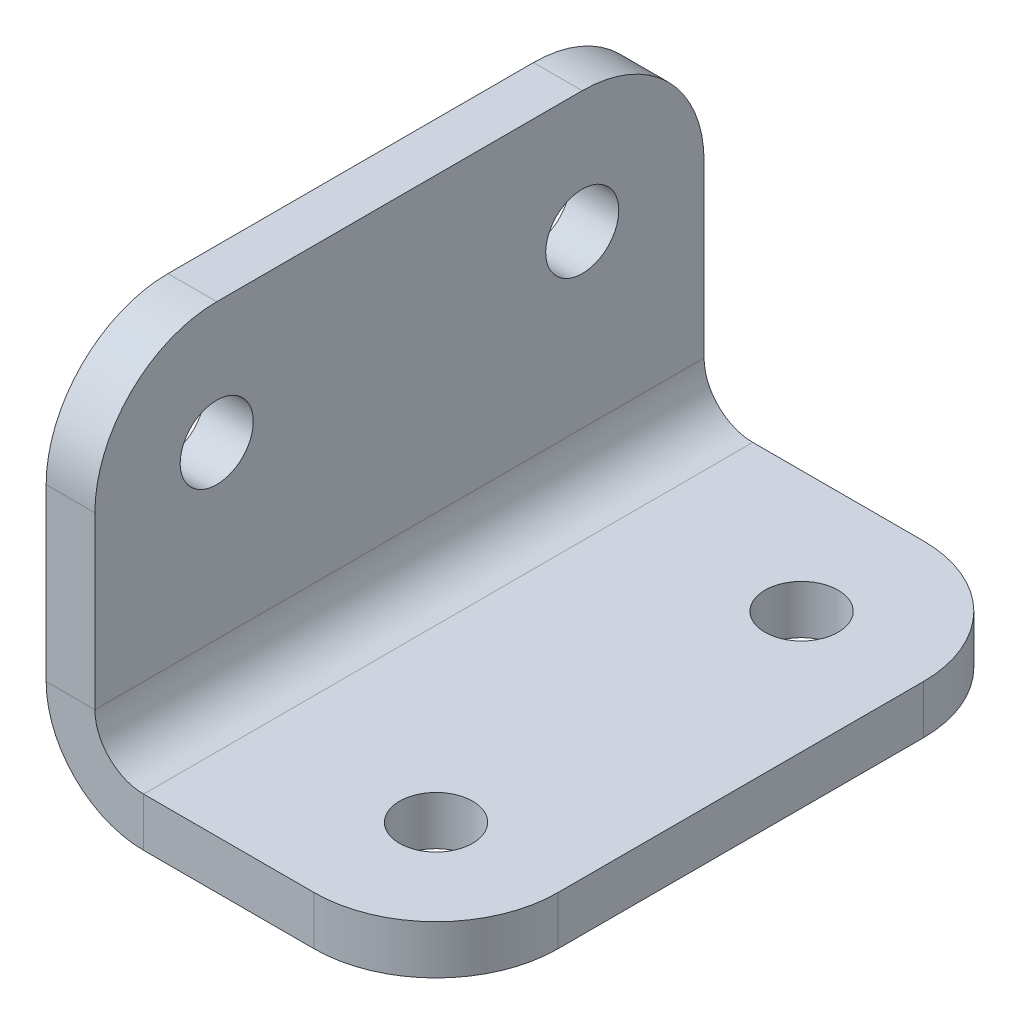
ISO-10303-21;
HEADER;
FILE_DESCRIPTION(('STEP AP214'),'2;1');
FILE_NAME('part.step','',(''),(''),'','','');
FILE_SCHEMA(('AUTOMOTIVE_DESIGN { 1 0 10303 214 1 1 1 1 }'));
ENDSEC;
DATA;
#1=APPLICATION_CONTEXT('core data for automotive mechanical design processes');
#2=APPLICATION_PROTOCOL_DEFINITION('international standard','automotive_design',2000,#1);
#3=PRODUCT_CONTEXT('',#1,'mechanical');
#4=PRODUCT('Part','Part','',(#3));
#5=PRODUCT_RELATED_PRODUCT_CATEGORY('part','',(#4));
#6=PRODUCT_DEFINITION_FORMATION('','',#4);
#7=PRODUCT_DEFINITION_CONTEXT('part definition',#1,'design');
#8=PRODUCT_DEFINITION('design','',#6,#7);
#9=PRODUCT_DEFINITION_SHAPE('','',#8);
#10=(LENGTH_UNIT() NAMED_UNIT(*) SI_UNIT(.MILLI.,.METRE.));
#11=(NAMED_UNIT(*) PLANE_ANGLE_UNIT() SI_UNIT($,.RADIAN.));
#12=(NAMED_UNIT(*) SI_UNIT($,.STERADIAN.) SOLID_ANGLE_UNIT());
#13=UNCERTAINTY_MEASURE_WITH_UNIT(LENGTH_MEASURE(1.E-05),#10,'distance_accuracy_value','');
#14=(GEOMETRIC_REPRESENTATION_CONTEXT(3) GLOBAL_UNCERTAINTY_ASSIGNED_CONTEXT((#13)) GLOBAL_UNIT_ASSIGNED_CONTEXT((#10,
#11,#12)) REPRESENTATION_CONTEXT('',''));
#15=CARTESIAN_POINT('',(0.,0.,0.));
#16=DIRECTION('',(0.,0.,1.));
#17=DIRECTION('',(1.,0.,0.));
#18=AXIS2_PLACEMENT_3D('',#15,#16,#17);
#19=CARTESIAN_POINT('',(4.,2.,25.));
#20=DIRECTION('',(0.,0.,1.));
#21=DIRECTION('',(1.,0.,0.));
#22=AXIS2_PLACEMENT_3D('',#19,#20,#21);
#23=PLANE('',#22);
#24=DIRECTION('',(0.,-1.,0.));
#25=VECTOR('',#24,1.);
#26=CARTESIAN_POINT('',(2.,20.,25.));
#27=LINE('',#26,#25);
#28=CARTESIAN_POINT('',(2.,11.,25.));
#29=VERTEX_POINT('',#28);
#30=CARTESIAN_POINT('',(2.,4.,25.));
#31=VERTEX_POINT('',#30);
#32=EDGE_CURVE('E254',#29,#31,#27,.T.);
#33=ORIENTED_EDGE('',*,*,#32,.F.);
#34=DIRECTION('',(1.,0.,0.));
#35=VECTOR('',#34,1.);
#36=CARTESIAN_POINT('',(0.,11.,25.));
#37=LINE('',#36,#35);
#38=CARTESIAN_POINT('',(0.,11.,25.));
#39=VERTEX_POINT('',#38);
#40=EDGE_CURVE('E174',#39,#29,#37,.T.);
#41=ORIENTED_EDGE('',*,*,#40,.F.);
#42=DIRECTION('',(0.,-1.,0.));
#43=VECTOR('',#42,1.);
#44=CARTESIAN_POINT('',(0.,20.,25.));
#45=LINE('',#44,#43);
#46=CARTESIAN_POINT('',(0.,4.,25.));
#47=VERTEX_POINT('',#46);
#48=EDGE_CURVE('E156',#39,#47,#45,.T.);
#49=ORIENTED_EDGE('',*,*,#48,.T.);
#50=DIRECTION('',(1.,0.,0.));
#51=VECTOR('',#50,1.);
#52=CARTESIAN_POINT('',(0.,4.,25.));
#53=LINE('',#52,#51);
#54=EDGE_CURVE('E11',#47,#31,#53,.T.);
#55=ORIENTED_EDGE('',*,*,#54,.T.);
#56=EDGE_LOOP('',(#33,#41,#49,#55));
#57=FACE_BOUND('',#56,.T.);
#58=ADVANCED_FACE('F40',(#57),#23,.T.);
#59=CARTESIAN_POINT('',(4.,4.,0.));
#60=DIRECTION('',(0.,0.,1.));
#61=DIRECTION('',(1.,0.,0.));
#62=AXIS2_PLACEMENT_3D('',#59,#60,#61);
#63=PLANE('',#62);
#64=DIRECTION('',(1.,0.,0.));
#65=VECTOR('',#64,1.);
#66=CARTESIAN_POINT('',(0.,11.,0.));
#67=LINE('',#66,#65);
#68=CARTESIAN_POINT('',(0.,11.,0.));
#69=VERTEX_POINT('',#68);
#70=CARTESIAN_POINT('',(2.,11.,0.));
#71=VERTEX_POINT('',#70);
#72=EDGE_CURVE('E178',#69,#71,#67,.T.);
#73=ORIENTED_EDGE('',*,*,#72,.T.);
#74=DIRECTION('',(0.,-1.,0.));
#75=VECTOR('',#74,1.);
#76=CARTESIAN_POINT('',(2.,20.,0.));
#77=LINE('',#76,#75);
#78=CARTESIAN_POINT('',(2.,4.,0.));
#79=VERTEX_POINT('',#78);
#80=EDGE_CURVE('E274',#71,#79,#77,.T.);
#81=ORIENTED_EDGE('',*,*,#80,.T.);
#82=DIRECTION('',(-1.,0.,0.));
#83=VECTOR('',#82,1.);
#84=CARTESIAN_POINT('',(2.,4.,0.));
#85=LINE('',#84,#83);
#86=CARTESIAN_POINT('',(0.,4.,0.));
#87=VERTEX_POINT('',#86);
#88=EDGE_CURVE('E298',#79,#87,#85,.T.);
#89=ORIENTED_EDGE('',*,*,#88,.T.);
#90=DIRECTION('',(0.,-1.,0.));
#91=VECTOR('',#90,1.);
#92=CARTESIAN_POINT('',(0.,20.,0.));
#93=LINE('',#92,#91);
#94=EDGE_CURVE('E277',#69,#87,#93,.T.);
#95=ORIENTED_EDGE('',*,*,#94,.F.);
#96=EDGE_LOOP('',(#73,#81,#89,#95));
#97=FACE_BOUND('',#96,.T.);
#98=ADVANCED_FACE('F342',(#97),#63,.F.);
#99=CARTESIAN_POINT('',(2.,4.,0.));
#100=DIRECTION('',(0.,0.,-1.));
#101=DIRECTION('',(-1.,0.,0.));
#102=AXIS2_PLACEMENT_3D('',#99,#100,#101);
#103=PLANE('',#102);
#104=DIRECTION('',(1.,0.,0.));
#105=VECTOR('',#104,1.);
#106=CARTESIAN_POINT('',(0.,2.,0.));
#107=LINE('',#106,#105);
#108=CARTESIAN_POINT('',(4.,2.,0.));
#109=VERTEX_POINT('',#108);
#110=CARTESIAN_POINT('',(11.,2.,0.));
#111=VERTEX_POINT('',#110);
#112=EDGE_CURVE('E267',#109,#111,#107,.T.);
#113=ORIENTED_EDGE('',*,*,#112,.T.);
#114=DIRECTION('',(0.,1.,0.));
#115=VECTOR('',#114,1.);
#116=CARTESIAN_POINT('',(11.,0.,0.));
#117=LINE('',#116,#115);
#118=CARTESIAN_POINT('',(11.,0.,0.));
#119=VERTEX_POINT('',#118);
#120=EDGE_CURVE('E221',#119,#111,#117,.T.);
#121=ORIENTED_EDGE('',*,*,#120,.F.);
#122=DIRECTION('',(1.,0.,0.));
#123=VECTOR('',#122,1.);
#124=CARTESIAN_POINT('',(0.,0.,0.));
#125=LINE('',#124,#123);
#126=CARTESIAN_POINT('',(4.,0.,0.));
#127=VERTEX_POINT('',#126);
#128=EDGE_CURVE('E237',#127,#119,#125,.T.);
#129=ORIENTED_EDGE('',*,*,#128,.F.);
#130=DIRECTION('',(0.,1.,0.));
#131=VECTOR('',#130,1.);
#132=CARTESIAN_POINT('',(4.,0.,0.));
#133=LINE('',#132,#131);
#134=EDGE_CURVE('E302',#127,#109,#133,.T.);
#135=ORIENTED_EDGE('',*,*,#134,.T.);
#136=EDGE_LOOP('',(#113,#121,#129,#135));
#137=FACE_BOUND('',#136,.T.);
#138=ADVANCED_FACE('F346',(#137),#103,.T.);
#139=CARTESIAN_POINT('',(0.,4.,25.));
#140=DIRECTION('',(0.,0.,1.));
#141=DIRECTION('',(1.,0.,0.));
#142=AXIS2_PLACEMENT_3D('',#139,#140,#141);
#143=PLANE('',#142);
#144=ORIENTED_EDGE('',*,*,#54,.F.);
#145=CARTESIAN_POINT('',(4.,4.,25.));
#146=DIRECTION('',(0.,0.,-1.));
#147=DIRECTION('',(-1.,0.,0.));
#148=AXIS2_PLACEMENT_3D('',#145,#146,#147);
#149=CIRCLE('',#148,4.);
#150=CARTESIAN_POINT('',(4.,0.,25.));
#151=VERTEX_POINT('',#150);
#152=EDGE_CURVE('E259',#47,#151,#149,.F.);
#153=ORIENTED_EDGE('',*,*,#152,.T.);
#154=DIRECTION('',(0.,-1.,0.));
#155=VECTOR('',#154,1.);
#156=CARTESIAN_POINT('',(4.,2.,25.));
#157=LINE('',#156,#155);
#158=CARTESIAN_POINT('',(4.,2.,25.));
#159=VERTEX_POINT('',#158);
#160=EDGE_CURVE('E49',#159,#151,#157,.T.);
#161=ORIENTED_EDGE('',*,*,#160,.F.);
#162=CARTESIAN_POINT('',(4.,4.,25.));
#163=DIRECTION('',(0.,0.,1.));
#164=DIRECTION('',(1.,0.,0.));
#165=AXIS2_PLACEMENT_3D('',#162,#163,#164);
#166=CIRCLE('',#165,2.);
#167=EDGE_CURVE('E250',#31,#159,#166,.T.);
#168=ORIENTED_EDGE('',*,*,#167,.F.);
#169=EDGE_LOOP('',(#144,#153,#161,#168));
#170=FACE_BOUND('',#169,.T.);
#171=ADVANCED_FACE('F42',(#170),#143,.T.);
#172=CARTESIAN_POINT('',(4.,0.,0.));
#173=DIRECTION('',(0.,0.,-1.));
#174=DIRECTION('',(-1.,0.,0.));
#175=AXIS2_PLACEMENT_3D('',#172,#173,#174);
#176=PLANE('',#175);
#177=ORIENTED_EDGE('',*,*,#134,.F.);
#178=CARTESIAN_POINT('',(4.,4.,0.));
#179=DIRECTION('',(0.,0.,-1.));
#180=DIRECTION('',(-1.,0.,0.));
#181=AXIS2_PLACEMENT_3D('',#178,#179,#180);
#182=CIRCLE('',#181,4.);
#183=EDGE_CURVE('E246',#87,#127,#182,.F.);
#184=ORIENTED_EDGE('',*,*,#183,.F.);
#185=ORIENTED_EDGE('',*,*,#88,.F.);
#186=CARTESIAN_POINT('',(4.,4.,0.));
#187=DIRECTION('',(0.,0.,1.));
#188=DIRECTION('',(1.,0.,0.));
#189=AXIS2_PLACEMENT_3D('',#186,#187,#188);
#190=CIRCLE('',#189,2.);
#191=EDGE_CURVE('E270',#79,#109,#190,.T.);
#192=ORIENTED_EDGE('',*,*,#191,.T.);
#193=EDGE_LOOP('',(#177,#184,#185,#192));
#194=FACE_BOUND('',#193,.T.);
#195=ADVANCED_FACE('F350',(#194),#176,.T.);
#196=CARTESIAN_POINT('',(0.,0.,25.));
#197=DIRECTION('',(0.,1.,0.));
#198=DIRECTION('',(0.,0.,1.));
#199=AXIS2_PLACEMENT_3D('',#196,#197,#198);
#200=PLANE('',#199);
#201=CARTESIAN_POINT('',(11.,0.,20.));
#202=DIRECTION('',(0.,1.,0.));
#203=DIRECTION('',(0.,0.,-1.));
#204=AXIS2_PLACEMENT_3D('',#201,#202,#203);
#205=CIRCLE('',#204,1.5);
#206=CARTESIAN_POINT('',(11.,0.,18.5));
#207=VERTEX_POINT('',#206);
#208=EDGE_CURVE('E191',#207,#207,#205,.T.);
#209=ORIENTED_EDGE('',*,*,#208,.T.);
#210=EDGE_LOOP('',(#209));
#211=FACE_BOUND('',#210,.T.);
#212=ORIENTED_EDGE('',*,*,#128,.T.);
#213=CARTESIAN_POINT('',(11.,0.,5.));
#214=DIRECTION('',(0.,-1.,0.));
#215=DIRECTION('',(0.,0.,1.));
#216=AXIS2_PLACEMENT_3D('',#213,#214,#215);
#217=CIRCLE('',#216,5.);
#218=CARTESIAN_POINT('',(16.,0.,5.));
#219=VERTEX_POINT('',#218);
#220=EDGE_CURVE('E199',#119,#219,#217,.T.);
#221=ORIENTED_EDGE('',*,*,#220,.T.);
#222=DIRECTION('',(0.,0.,1.));
#223=VECTOR('',#222,1.);
#224=CARTESIAN_POINT('',(16.,0.,5.));
#225=LINE('',#224,#223);
#226=CARTESIAN_POINT('',(16.,0.,20.));
#227=VERTEX_POINT('',#226);
#228=EDGE_CURVE('E203',#219,#227,#225,.T.);
#229=ORIENTED_EDGE('',*,*,#228,.T.);
#230=CARTESIAN_POINT('',(11.,0.,20.));
#231=DIRECTION('',(0.,-1.,0.));
#232=DIRECTION('',(0.,0.,-1.));
#233=AXIS2_PLACEMENT_3D('',#230,#231,#232);
#234=CIRCLE('',#233,5.);
#235=CARTESIAN_POINT('',(11.,0.,25.));
#236=VERTEX_POINT('',#235);
#237=EDGE_CURVE('E207',#227,#236,#234,.T.);
#238=ORIENTED_EDGE('',*,*,#237,.T.);
#239=DIRECTION('',(1.,0.,0.));
#240=VECTOR('',#239,1.);
#241=CARTESIAN_POINT('',(0.,0.,25.));
#242=LINE('',#241,#240);
#243=EDGE_CURVE('E241',#151,#236,#242,.T.);
#244=ORIENTED_EDGE('',*,*,#243,.F.);
#245=DIRECTION('',(0.,0.,-1.));
#246=VECTOR('',#245,1.);
#247=CARTESIAN_POINT('',(4.,0.,25.));
#248=LINE('',#247,#246);
#249=EDGE_CURVE('E263',#151,#127,#248,.T.);
#250=ORIENTED_EDGE('',*,*,#249,.T.);
#251=EDGE_LOOP('',(#212,#221,#229,#238,#244,#250));
#252=FACE_BOUND('',#251,.T.);
#253=CARTESIAN_POINT('',(11.,0.,5.));
#254=DIRECTION('',(0.,1.,0.));
#255=DIRECTION('',(0.,0.,1.));
#256=AXIS2_PLACEMENT_3D('',#253,#254,#255);
#257=CIRCLE('',#256,1.5);
#258=CARTESIAN_POINT('',(11.,0.,6.5));
#259=VERTEX_POINT('',#258);
#260=EDGE_CURVE('E233',#259,#259,#257,.T.);
#261=ORIENTED_EDGE('',*,*,#260,.T.);
#262=EDGE_LOOP('',(#261));
#263=FACE_BOUND('',#262,.T.);
#264=ADVANCED_FACE('F320',(#211,#252,#263),#200,.F.);
#265=CARTESIAN_POINT('',(0.,2.,25.));
#266=DIRECTION('',(0.,1.,0.));
#267=DIRECTION('',(0.,0.,1.));
#268=AXIS2_PLACEMENT_3D('',#265,#266,#267);
#269=PLANE('',#268);
#270=CARTESIAN_POINT('',(11.,2.,20.));
#271=DIRECTION('',(0.,1.,0.));
#272=DIRECTION('',(0.,0.,-1.));
#273=AXIS2_PLACEMENT_3D('',#270,#271,#272);
#274=CIRCLE('',#273,1.5);
#275=CARTESIAN_POINT('',(11.,2.,18.5));
#276=VERTEX_POINT('',#275);
#277=EDGE_CURVE('E187',#276,#276,#274,.T.);
#278=ORIENTED_EDGE('',*,*,#277,.F.);
#279=EDGE_LOOP('',(#278));
#280=FACE_BOUND('',#279,.T.);
#281=CARTESIAN_POINT('',(11.,2.,5.));
#282=DIRECTION('',(0.,-1.,0.));
#283=DIRECTION('',(0.,0.,1.));
#284=AXIS2_PLACEMENT_3D('',#281,#282,#283);
#285=CIRCLE('',#284,5.);
#286=CARTESIAN_POINT('',(16.,2.,5.));
#287=VERTEX_POINT('',#286);
#288=EDGE_CURVE('E195',#111,#287,#285,.T.);
#289=ORIENTED_EDGE('',*,*,#288,.F.);
#290=ORIENTED_EDGE('',*,*,#112,.F.);
#291=DIRECTION('',(0.,0.,-1.));
#292=VECTOR('',#291,1.);
#293=CARTESIAN_POINT('',(4.,2.,25.));
#294=LINE('',#293,#292);
#295=EDGE_CURVE('E294',#159,#109,#294,.T.);
#296=ORIENTED_EDGE('',*,*,#295,.F.);
#297=DIRECTION('',(1.,0.,0.));
#298=VECTOR('',#297,1.);
#299=CARTESIAN_POINT('',(0.,2.,25.));
#300=LINE('',#299,#298);
#301=CARTESIAN_POINT('',(11.,2.,25.));
#302=VERTEX_POINT('',#301);
#303=EDGE_CURVE('E245',#159,#302,#300,.T.);
#304=ORIENTED_EDGE('',*,*,#303,.T.);
#305=CARTESIAN_POINT('',(11.,2.,20.));
#306=DIRECTION('',(0.,-1.,0.));
#307=DIRECTION('',(0.,0.,-1.));
#308=AXIS2_PLACEMENT_3D('',#305,#306,#307);
#309=CIRCLE('',#308,5.);
#310=CARTESIAN_POINT('',(16.,2.,20.));
#311=VERTEX_POINT('',#310);
#312=EDGE_CURVE('E64',#311,#302,#309,.T.);
#313=ORIENTED_EDGE('',*,*,#312,.F.);
#314=DIRECTION('',(0.,0.,1.));
#315=VECTOR('',#314,1.);
#316=CARTESIAN_POINT('',(16.,2.,5.));
#317=LINE('',#316,#315);
#318=EDGE_CURVE('E215',#287,#311,#317,.T.);
#319=ORIENTED_EDGE('',*,*,#318,.F.);
#320=EDGE_LOOP('',(#289,#290,#296,#304,#313,#319));
#321=FACE_BOUND('',#320,.T.);
#322=CARTESIAN_POINT('',(11.,2.,5.));
#323=DIRECTION('',(0.,1.,0.));
#324=DIRECTION('',(0.,0.,1.));
#325=AXIS2_PLACEMENT_3D('',#322,#323,#324);
#326=CIRCLE('',#325,1.5);
#327=CARTESIAN_POINT('',(11.,2.,6.5));
#328=VERTEX_POINT('',#327);
#329=EDGE_CURVE('E224',#328,#328,#326,.T.);
#330=ORIENTED_EDGE('',*,*,#329,.F.);
#331=EDGE_LOOP('',(#330));
#332=FACE_BOUND('',#331,.T.);
#333=ADVANCED_FACE('F327',(#280,#321,#332),#269,.T.);
#334=CARTESIAN_POINT('',(4.,4.,25.));
#335=DIRECTION('',(0.,0.,-1.));
#336=DIRECTION('',(-1.,0.,0.));
#337=AXIS2_PLACEMENT_3D('',#334,#335,#336);
#338=CYLINDRICAL_SURFACE('',#337,2.);
#339=ORIENTED_EDGE('',*,*,#191,.F.);
#340=DIRECTION('',(0.,0.,-1.));
#341=VECTOR('',#340,1.);
#342=CARTESIAN_POINT('',(2.,4.,25.));
#343=LINE('',#342,#341);
#344=EDGE_CURVE('E290',#31,#79,#343,.T.);
#345=ORIENTED_EDGE('',*,*,#344,.F.);
#346=ORIENTED_EDGE('',*,*,#167,.T.);
#347=ORIENTED_EDGE('',*,*,#295,.T.);
#348=EDGE_LOOP('',(#339,#345,#346,#347));
#349=FACE_BOUND('',#348,.T.);
#350=ADVANCED_FACE('F333',(#349),#338,.F.);
#351=CARTESIAN_POINT('',(2.,20.,25.));
#352=DIRECTION('',(1.,0.,0.));
#353=DIRECTION('',(0.,1.,0.));
#354=AXIS2_PLACEMENT_3D('',#351,#352,#353);
#355=PLANE('',#354);
#356=CARTESIAN_POINT('',(2.,11.,5.));
#357=DIRECTION('',(1.,0.,0.));
#358=DIRECTION('',(0.,-1.,0.));
#359=AXIS2_PLACEMENT_3D('',#356,#357,#358);
#360=CIRCLE('',#359,1.5);
#361=CARTESIAN_POINT('',(2.,9.5,5.));
#362=VERTEX_POINT('',#361);
#363=EDGE_CURVE('E165',#362,#362,#360,.T.);
#364=ORIENTED_EDGE('',*,*,#363,.F.);
#365=EDGE_LOOP('',(#364));
#366=FACE_BOUND('',#365,.T.);
#367=CARTESIAN_POINT('',(2.,11.,20.));
#368=DIRECTION('',(-1.,0.,0.));
#369=DIRECTION('',(0.,1.,0.));
#370=AXIS2_PLACEMENT_3D('',#367,#368,#369);
#371=CIRCLE('',#370,5.00000000000001);
#372=CARTESIAN_POINT('',(2.,16.,20.));
#373=VERTEX_POINT('',#372);
#374=EDGE_CURVE('E136',#29,#373,#371,.T.);
#375=ORIENTED_EDGE('',*,*,#374,.F.);
#376=ORIENTED_EDGE('',*,*,#32,.T.);
#377=ORIENTED_EDGE('',*,*,#344,.T.);
#378=ORIENTED_EDGE('',*,*,#80,.F.);
#379=CARTESIAN_POINT('',(2.,11.,5.));
#380=DIRECTION('',(-1.,0.,0.));
#381=DIRECTION('',(0.,-1.,0.));
#382=AXIS2_PLACEMENT_3D('',#379,#380,#381);
#383=CIRCLE('',#382,5.00000000000001);
#384=CARTESIAN_POINT('',(2.,16.,5.00000000000001));
#385=VERTEX_POINT('',#384);
#386=EDGE_CURVE('E56',#385,#71,#383,.T.);
#387=ORIENTED_EDGE('',*,*,#386,.F.);
#388=DIRECTION('',(0.,0.,-1.));
#389=VECTOR('',#388,1.);
#390=CARTESIAN_POINT('',(2.,16.,20.));
#391=LINE('',#390,#389);
#392=EDGE_CURVE('E162',#373,#385,#391,.T.);
#393=ORIENTED_EDGE('',*,*,#392,.F.);
#394=EDGE_LOOP('',(#375,#376,#377,#378,#387,#393));
#395=FACE_BOUND('',#394,.T.);
#396=CARTESIAN_POINT('',(2.,11.,20.));
#397=DIRECTION('',(1.,0.,0.));
#398=DIRECTION('',(0.,1.,0.));
#399=AXIS2_PLACEMENT_3D('',#396,#397,#398);
#400=CIRCLE('',#399,1.5);
#401=CARTESIAN_POINT('',(2.,12.5,20.));
#402=VERTEX_POINT('',#401);
#403=EDGE_CURVE('E177',#402,#402,#400,.T.);
#404=ORIENTED_EDGE('',*,*,#403,.F.);
#405=EDGE_LOOP('',(#404));
#406=FACE_BOUND('',#405,.T.);
#407=ADVANCED_FACE('F337',(#366,#395,#406),#355,.T.);
#408=CARTESIAN_POINT('',(0.,20.,25.));
#409=DIRECTION('',(1.,0.,0.));
#410=DIRECTION('',(0.,1.,0.));
#411=AXIS2_PLACEMENT_3D('',#408,#409,#410);
#412=PLANE('',#411);
#413=CARTESIAN_POINT('',(0.,11.,5.));
#414=DIRECTION('',(1.,0.,0.));
#415=DIRECTION('',(0.,-1.,0.));
#416=AXIS2_PLACEMENT_3D('',#413,#414,#415);
#417=CIRCLE('',#416,1.5);
#418=CARTESIAN_POINT('',(0.,9.5,5.));
#419=VERTEX_POINT('',#418);
#420=EDGE_CURVE('E172',#419,#419,#417,.T.);
#421=ORIENTED_EDGE('',*,*,#420,.T.);
#422=EDGE_LOOP('',(#421));
#423=FACE_BOUND('',#422,.T.);
#424=ORIENTED_EDGE('',*,*,#48,.F.);
#425=CARTESIAN_POINT('',(0.,11.,20.));
#426=DIRECTION('',(-1.,0.,0.));
#427=DIRECTION('',(0.,1.,0.));
#428=AXIS2_PLACEMENT_3D('',#425,#426,#427);
#429=CIRCLE('',#428,5.00000000000001);
#430=CARTESIAN_POINT('',(0.,16.,20.));
#431=VERTEX_POINT('',#430);
#432=EDGE_CURVE('E133',#39,#431,#429,.T.);
#433=ORIENTED_EDGE('',*,*,#432,.T.);
#434=DIRECTION('',(0.,0.,-1.));
#435=VECTOR('',#434,1.);
#436=CARTESIAN_POINT('',(0.,16.,20.));
#437=LINE('',#436,#435);
#438=CARTESIAN_POINT('',(0.,16.,5.00000000000001));
#439=VERTEX_POINT('',#438);
#440=EDGE_CURVE('E145',#431,#439,#437,.T.);
#441=ORIENTED_EDGE('',*,*,#440,.T.);
#442=CARTESIAN_POINT('',(0.,11.,5.));
#443=DIRECTION('',(-1.,0.,0.));
#444=DIRECTION('',(0.,-1.,0.));
#445=AXIS2_PLACEMENT_3D('',#442,#443,#444);
#446=CIRCLE('',#445,5.00000000000001);
#447=EDGE_CURVE('E142',#439,#69,#446,.T.);
#448=ORIENTED_EDGE('',*,*,#447,.T.);
#449=ORIENTED_EDGE('',*,*,#94,.T.);
#450=DIRECTION('',(0.,0.,-1.));
#451=VECTOR('',#450,1.);
#452=CARTESIAN_POINT('',(0.,4.,25.));
#453=LINE('',#452,#451);
#454=EDGE_CURVE('E286',#47,#87,#453,.T.);
#455=ORIENTED_EDGE('',*,*,#454,.F.);
#456=EDGE_LOOP('',(#424,#433,#441,#448,#449,#455));
#457=FACE_BOUND('',#456,.T.);
#458=CARTESIAN_POINT('',(0.,11.,20.));
#459=DIRECTION('',(1.,0.,0.));
#460=DIRECTION('',(0.,1.,0.));
#461=AXIS2_PLACEMENT_3D('',#458,#459,#460);
#462=CIRCLE('',#461,1.5);
#463=CARTESIAN_POINT('',(0.,12.5,20.));
#464=VERTEX_POINT('',#463);
#465=EDGE_CURVE('E183',#464,#464,#462,.T.);
#466=ORIENTED_EDGE('',*,*,#465,.T.);
#467=EDGE_LOOP('',(#466));
#468=FACE_BOUND('',#467,.T.);
#469=ADVANCED_FACE('F153',(#423,#457,#468),#412,.F.);
#470=CARTESIAN_POINT('',(4.,4.,25.));
#471=DIRECTION('',(0.,0.,-1.));
#472=DIRECTION('',(-1.,0.,0.));
#473=AXIS2_PLACEMENT_3D('',#470,#471,#472);
#474=CYLINDRICAL_SURFACE('',#473,4.);
#475=ORIENTED_EDGE('',*,*,#183,.T.);
#476=ORIENTED_EDGE('',*,*,#249,.F.);
#477=ORIENTED_EDGE('',*,*,#152,.F.);
#478=ORIENTED_EDGE('',*,*,#454,.T.);
#479=EDGE_LOOP('',(#475,#476,#477,#478));
#480=FACE_BOUND('',#479,.T.);
#481=ADVANCED_FACE('F316',(#480),#474,.T.);
#482=CARTESIAN_POINT('',(4.,4.,25.));
#483=DIRECTION('',(0.,0.,1.));
#484=DIRECTION('',(1.,0.,0.));
#485=AXIS2_PLACEMENT_3D('',#482,#483,#484);
#486=PLANE('',#485);
#487=DIRECTION('',(0.,1.,0.));
#488=VECTOR('',#487,1.);
#489=CARTESIAN_POINT('',(11.,0.,25.));
#490=LINE('',#489,#488);
#491=EDGE_CURVE('E225',#236,#302,#490,.T.);
#492=ORIENTED_EDGE('',*,*,#491,.T.);
#493=ORIENTED_EDGE('',*,*,#303,.F.);
#494=ORIENTED_EDGE('',*,*,#160,.T.);
#495=ORIENTED_EDGE('',*,*,#243,.T.);
#496=EDGE_LOOP('',(#492,#493,#494,#495));
#497=FACE_BOUND('',#496,.T.);
#498=ADVANCED_FACE('F307',(#497),#486,.T.);
#499=CARTESIAN_POINT('',(11.,0.,5.));
#500=DIRECTION('',(0.,1.,0.));
#501=DIRECTION('',(0.,0.,1.));
#502=AXIS2_PLACEMENT_3D('',#499,#500,#501);
#503=CYLINDRICAL_SURFACE('',#502,1.5);
#504=ORIENTED_EDGE('',*,*,#260,.F.);
#505=EDGE_LOOP('',(#504));
#506=FACE_BOUND('',#505,.T.);
#507=ORIENTED_EDGE('',*,*,#329,.T.);
#508=EDGE_LOOP('',(#507));
#509=FACE_BOUND('',#508,.T.);
#510=ADVANCED_FACE('F375',(#506,#509),#503,.F.);
#511=CARTESIAN_POINT('',(11.,0.,5.));
#512=DIRECTION('',(0.,1.,0.));
#513=DIRECTION('',(0.,0.,1.));
#514=AXIS2_PLACEMENT_3D('',#511,#512,#513);
#515=CYLINDRICAL_SURFACE('',#514,5.);
#516=ORIENTED_EDGE('',*,*,#288,.T.);
#517=DIRECTION('',(0.,1.,0.));
#518=VECTOR('',#517,1.);
#519=CARTESIAN_POINT('',(16.,0.,5.));
#520=LINE('',#519,#518);
#521=EDGE_CURVE('E211',#219,#287,#520,.T.);
#522=ORIENTED_EDGE('',*,*,#521,.F.);
#523=ORIENTED_EDGE('',*,*,#220,.F.);
#524=ORIENTED_EDGE('',*,*,#120,.T.);
#525=EDGE_LOOP('',(#516,#522,#523,#524));
#526=FACE_BOUND('',#525,.T.);
#527=ADVANCED_FACE('F378',(#526),#515,.T.);
#528=CARTESIAN_POINT('',(11.,0.,20.));
#529=DIRECTION('',(0.,1.,0.));
#530=DIRECTION('',(0.,0.,1.));
#531=AXIS2_PLACEMENT_3D('',#528,#529,#530);
#532=CYLINDRICAL_SURFACE('',#531,5.);
#533=ORIENTED_EDGE('',*,*,#312,.T.);
#534=ORIENTED_EDGE('',*,*,#491,.F.);
#535=ORIENTED_EDGE('',*,*,#237,.F.);
#536=DIRECTION('',(0.,1.,0.));
#537=VECTOR('',#536,1.);
#538=CARTESIAN_POINT('',(16.,0.,20.));
#539=LINE('',#538,#537);
#540=EDGE_CURVE('E228',#227,#311,#539,.T.);
#541=ORIENTED_EDGE('',*,*,#540,.T.);
#542=EDGE_LOOP('',(#533,#534,#535,#541));
#543=FACE_BOUND('',#542,.T.);
#544=ADVANCED_FACE('F324',(#543),#532,.T.);
#545=CARTESIAN_POINT('',(16.,0.,5.));
#546=DIRECTION('',(-1.,0.,0.));
#547=DIRECTION('',(0.,0.,1.));
#548=AXIS2_PLACEMENT_3D('',#545,#546,#547);
#549=PLANE('',#548);
#550=ORIENTED_EDGE('',*,*,#318,.T.);
#551=ORIENTED_EDGE('',*,*,#540,.F.);
#552=ORIENTED_EDGE('',*,*,#228,.F.);
#553=ORIENTED_EDGE('',*,*,#521,.T.);
#554=EDGE_LOOP('',(#550,#551,#552,#553));
#555=FACE_BOUND('',#554,.T.);
#556=ADVANCED_FACE('F383',(#555),#549,.F.);
#557=CARTESIAN_POINT('',(11.,0.,20.));
#558=DIRECTION('',(0.,1.,0.));
#559=DIRECTION('',(0.,0.,1.));
#560=AXIS2_PLACEMENT_3D('',#557,#558,#559);
#561=CYLINDRICAL_SURFACE('',#560,1.5);
#562=ORIENTED_EDGE('',*,*,#208,.F.);
#563=EDGE_LOOP('',(#562));
#564=FACE_BOUND('',#563,.T.);
#565=ORIENTED_EDGE('',*,*,#277,.T.);
#566=EDGE_LOOP('',(#565));
#567=FACE_BOUND('',#566,.T.);
#568=ADVANCED_FACE('F386',(#564,#567),#561,.F.);
#569=CARTESIAN_POINT('',(0.,11.,20.));
#570=DIRECTION('',(1.,0.,0.));
#571=DIRECTION('',(0.,1.,0.));
#572=AXIS2_PLACEMENT_3D('',#569,#570,#571);
#573=CYLINDRICAL_SURFACE('',#572,1.5);
#574=ORIENTED_EDGE('',*,*,#465,.F.);
#575=EDGE_LOOP('',(#574));
#576=FACE_BOUND('',#575,.T.);
#577=ORIENTED_EDGE('',*,*,#403,.T.);
#578=EDGE_LOOP('',(#577));
#579=FACE_BOUND('',#578,.T.);
#580=ADVANCED_FACE('F392',(#576,#579),#573,.F.);
#581=CARTESIAN_POINT('',(0.,11.,20.));
#582=DIRECTION('',(1.,0.,0.));
#583=DIRECTION('',(0.,1.,0.));
#584=AXIS2_PLACEMENT_3D('',#581,#582,#583);
#585=CYLINDRICAL_SURFACE('',#584,5.00000000000001);
#586=ORIENTED_EDGE('',*,*,#374,.T.);
#587=DIRECTION('',(1.,0.,0.));
#588=VECTOR('',#587,1.);
#589=CARTESIAN_POINT('',(0.,16.,20.));
#590=LINE('',#589,#588);
#591=EDGE_CURVE('E129',#431,#373,#590,.T.);
#592=ORIENTED_EDGE('',*,*,#591,.F.);
#593=ORIENTED_EDGE('',*,*,#432,.F.);
#594=ORIENTED_EDGE('',*,*,#40,.T.);
#595=EDGE_LOOP('',(#586,#592,#593,#594));
#596=FACE_BOUND('',#595,.T.);
#597=ADVANCED_FACE('F131',(#596),#585,.T.);
#598=CARTESIAN_POINT('',(0.,11.,5.));
#599=DIRECTION('',(1.,0.,0.));
#600=DIRECTION('',(0.,1.,0.));
#601=AXIS2_PLACEMENT_3D('',#598,#599,#600);
#602=CYLINDRICAL_SURFACE('',#601,5.00000000000001);
#603=ORIENTED_EDGE('',*,*,#386,.T.);
#604=ORIENTED_EDGE('',*,*,#72,.F.);
#605=ORIENTED_EDGE('',*,*,#447,.F.);
#606=DIRECTION('',(1.,0.,0.));
#607=VECTOR('',#606,1.);
#608=CARTESIAN_POINT('',(0.,16.,5.00000000000001));
#609=LINE('',#608,#607);
#610=EDGE_CURVE('E141',#439,#385,#609,.T.);
#611=ORIENTED_EDGE('',*,*,#610,.T.);
#612=EDGE_LOOP('',(#603,#604,#605,#611));
#613=FACE_BOUND('',#612,.T.);
#614=ADVANCED_FACE('F399',(#613),#602,.T.);
#615=CARTESIAN_POINT('',(0.,16.,20.));
#616=DIRECTION('',(0.,-1.,0.));
#617=DIRECTION('',(1.,0.,0.));
#618=AXIS2_PLACEMENT_3D('',#615,#616,#617);
#619=PLANE('',#618);
#620=ORIENTED_EDGE('',*,*,#392,.T.);
#621=ORIENTED_EDGE('',*,*,#610,.F.);
#622=ORIENTED_EDGE('',*,*,#440,.F.);
#623=ORIENTED_EDGE('',*,*,#591,.T.);
#624=EDGE_LOOP('',(#620,#621,#622,#623));
#625=FACE_BOUND('',#624,.T.);
#626=ADVANCED_FACE('F146',(#625),#619,.F.);
#627=CARTESIAN_POINT('',(0.,11.,5.));
#628=DIRECTION('',(1.,0.,0.));
#629=DIRECTION('',(0.,1.,0.));
#630=AXIS2_PLACEMENT_3D('',#627,#628,#629);
#631=CYLINDRICAL_SURFACE('',#630,1.5);
#632=ORIENTED_EDGE('',*,*,#420,.F.);
#633=EDGE_LOOP('',(#632));
#634=FACE_BOUND('',#633,.T.);
#635=ORIENTED_EDGE('',*,*,#363,.T.);
#636=EDGE_LOOP('',(#635));
#637=FACE_BOUND('',#636,.T.);
#638=ADVANCED_FACE('F402',(#634,#637),#631,.F.);
#639=CLOSED_SHELL('',(#58,#98,#138,#171,#195,#264,#333,#350,#407,#469,#481,#498,#510,#527,#544,
#556,#568,#580,#597,#614,#626,#638));
#640=MANIFOLD_SOLID_BREP('B2',#639);
#641=ADVANCED_BREP_SHAPE_REPRESENTATION('',(#18,#640),#14);
#642=SHAPE_DEFINITION_REPRESENTATION(#9,#641);
ENDSEC;
END-ISO-10303-21;
